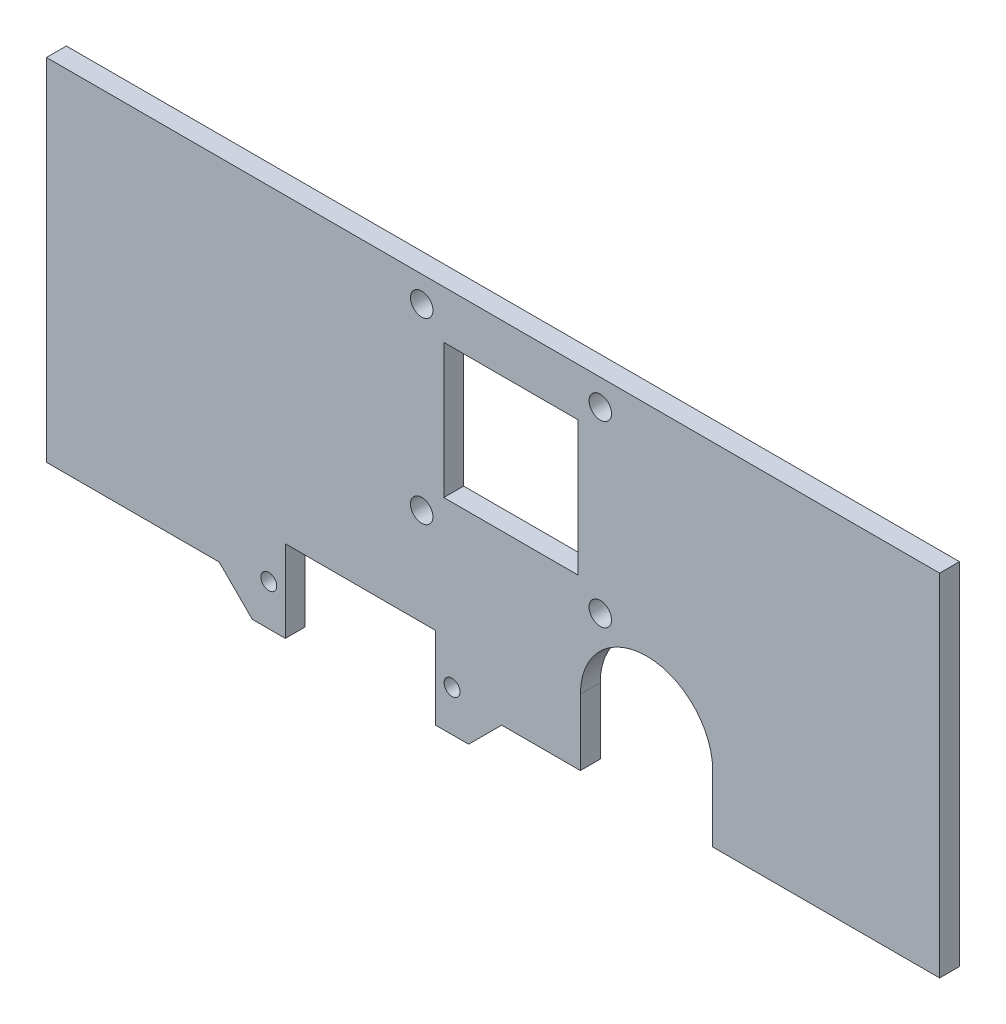
ISO-10303-21;
HEADER;
FILE_DESCRIPTION(('STEP AP214'),'2;1');
FILE_NAME('part.step','',(''),(''),'','','');
FILE_SCHEMA(('AUTOMOTIVE_DESIGN { 1 0 10303 214 1 1 1 1 }'));
ENDSEC;
DATA;
#1=APPLICATION_CONTEXT('core data for automotive mechanical design processes');
#2=APPLICATION_PROTOCOL_DEFINITION('international standard','automotive_design',2000,#1);
#3=PRODUCT_CONTEXT('',#1,'mechanical');
#4=PRODUCT('Part','Part','',(#3));
#5=PRODUCT_RELATED_PRODUCT_CATEGORY('part','',(#4));
#6=PRODUCT_DEFINITION_FORMATION('','',#4);
#7=PRODUCT_DEFINITION_CONTEXT('part definition',#1,'design');
#8=PRODUCT_DEFINITION('design','',#6,#7);
#9=PRODUCT_DEFINITION_SHAPE('','',#8);
#10=(LENGTH_UNIT() NAMED_UNIT(*) SI_UNIT(.MILLI.,.METRE.));
#11=(NAMED_UNIT(*) PLANE_ANGLE_UNIT() SI_UNIT($,.RADIAN.));
#12=(NAMED_UNIT(*) SI_UNIT($,.STERADIAN.) SOLID_ANGLE_UNIT());
#13=UNCERTAINTY_MEASURE_WITH_UNIT(LENGTH_MEASURE(1.E-05),#10,'distance_accuracy_value','');
#14=(GEOMETRIC_REPRESENTATION_CONTEXT(3) GLOBAL_UNCERTAINTY_ASSIGNED_CONTEXT((#13)) GLOBAL_UNIT_ASSIGNED_CONTEXT((#10,
#11,#12)) REPRESENTATION_CONTEXT('',''));
#15=CARTESIAN_POINT('',(0.,0.,0.));
#16=DIRECTION('',(0.,0.,1.));
#17=DIRECTION('',(1.,0.,0.));
#18=AXIS2_PLACEMENT_3D('',#15,#16,#17);
#19=CARTESIAN_POINT('',(0.,0.,3.));
#20=DIRECTION('',(0.,0.,-1.));
#21=DIRECTION('',(-1.,0.,0.));
#22=AXIS2_PLACEMENT_3D('',#19,#20,#21);
#23=PLANE('',#22);
#24=DIRECTION('',(-1.,0.,0.));
#25=VECTOR('',#24,1.);
#26=CARTESIAN_POINT('',(-30.6511945230726,54.0173248927136,3.));
#27=LINE('',#26,#25);
#28=CARTESIAN_POINT('',(-10.3311945230726,54.0173248927136,3.));
#29=VERTEX_POINT('',#28);
#30=CARTESIAN_POINT('',(-30.6511945230726,54.0173248927136,3.));
#31=VERTEX_POINT('',#30);
#32=EDGE_CURVE('E185',#29,#31,#27,.T.);
#33=ORIENTED_EDGE('',*,*,#32,.T.);
#34=DIRECTION('',(0.,1.,0.));
#35=VECTOR('',#34,1.);
#36=CARTESIAN_POINT('',(-30.6511945230726,54.0173248927136,3.));
#37=LINE('',#36,#35);
#38=CARTESIAN_POINT('',(-30.6511945230726,74.3373248927136,3.));
#39=VERTEX_POINT('',#38);
#40=EDGE_CURVE('E179',#31,#39,#37,.T.);
#41=ORIENTED_EDGE('',*,*,#40,.T.);
#42=DIRECTION('',(1.,0.,0.));
#43=VECTOR('',#42,1.);
#44=CARTESIAN_POINT('',(-30.6511945230726,74.3373248927136,3.));
#45=LINE('',#44,#43);
#46=CARTESIAN_POINT('',(-10.3311945230726,74.3373248927136,3.));
#47=VERTEX_POINT('',#46);
#48=EDGE_CURVE('E188',#39,#47,#45,.T.);
#49=ORIENTED_EDGE('',*,*,#48,.T.);
#50=DIRECTION('',(0.,-1.,0.));
#51=VECTOR('',#50,1.);
#52=CARTESIAN_POINT('',(-10.3311945230726,54.0173248927136,3.));
#53=LINE('',#52,#51);
#54=EDGE_CURVE('E50',#47,#29,#53,.T.);
#55=ORIENTED_EDGE('',*,*,#54,.T.);
#56=EDGE_LOOP('',(#33,#41,#49,#55));
#57=FACE_BOUND('',#56,.T.);
#58=CARTESIAN_POINT('',(-29.4,29.8,3.));
#59=DIRECTION('',(0.,0.,1.));
#60=DIRECTION('',(1.,0.,0.));
#61=AXIS2_PLACEMENT_3D('',#58,#59,#60);
#62=CIRCLE('',#61,1.2);
#63=CARTESIAN_POINT('',(-28.2,29.8,3.));
#64=VERTEX_POINT('',#63);
#65=EDGE_CURVE('E209',#64,#64,#62,.T.);
#66=ORIENTED_EDGE('',*,*,#65,.F.);
#67=EDGE_LOOP('',(#66));
#68=FACE_BOUND('',#67,.T.);
#69=CARTESIAN_POINT('',(-57.1,29.8,3.));
#70=DIRECTION('',(0.,0.,1.));
#71=DIRECTION('',(1.,0.,0.));
#72=AXIS2_PLACEMENT_3D('',#69,#70,#71);
#73=CIRCLE('',#72,1.2);
#74=CARTESIAN_POINT('',(-55.9,29.8,3.));
#75=VERTEX_POINT('',#74);
#76=EDGE_CURVE('E218',#75,#75,#73,.T.);
#77=ORIENTED_EDGE('',*,*,#76,.F.);
#78=EDGE_LOOP('',(#77));
#79=FACE_BOUND('',#78,.T.);
#80=CARTESIAN_POINT('',(-6.99119452307264,77.6773248927136,3.));
#81=DIRECTION('',(0.,0.,1.));
#82=DIRECTION('',(1.,0.,0.));
#83=AXIS2_PLACEMENT_3D('',#80,#81,#82);
#84=CIRCLE('',#83,1.7);
#85=CARTESIAN_POINT('',(-5.29119452307264,77.6773248927136,3.));
#86=VERTEX_POINT('',#85);
#87=EDGE_CURVE('E230',#86,#86,#84,.T.);
#88=ORIENTED_EDGE('',*,*,#87,.F.);
#89=EDGE_LOOP('',(#88));
#90=FACE_BOUND('',#89,.T.);
#91=CARTESIAN_POINT('',(-33.9911945230726,50.6773248927136,3.));
#92=DIRECTION('',(0.,0.,1.));
#93=DIRECTION('',(1.,0.,0.));
#94=AXIS2_PLACEMENT_3D('',#91,#92,#93);
#95=CIRCLE('',#94,1.7);
#96=CARTESIAN_POINT('',(-32.2911945230726,50.6773248927136,3.));
#97=VERTEX_POINT('',#96);
#98=EDGE_CURVE('E236',#97,#97,#95,.T.);
#99=ORIENTED_EDGE('',*,*,#98,.F.);
#100=EDGE_LOOP('',(#99));
#101=FACE_BOUND('',#100,.T.);
#102=CARTESIAN_POINT('',(-6.99119452307264,50.6773248927136,3.));
#103=DIRECTION('',(0.,0.,1.));
#104=DIRECTION('',(1.,0.,0.));
#105=AXIS2_PLACEMENT_3D('',#102,#103,#104);
#106=CIRCLE('',#105,1.7);
#107=CARTESIAN_POINT('',(-5.29119452307264,50.6773248927136,3.));
#108=VERTEX_POINT('',#107);
#109=EDGE_CURVE('E242',#108,#108,#106,.T.);
#110=ORIENTED_EDGE('',*,*,#109,.F.);
#111=EDGE_LOOP('',(#110));
#112=FACE_BOUND('',#111,.T.);
#113=DIRECTION('',(1.,0.,0.));
#114=VECTOR('',#113,1.);
#115=CARTESIAN_POINT('',(44.3,28.6,3.));
#116=LINE('',#115,#114);
#117=CARTESIAN_POINT('',(-90.7,28.6,3.));
#118=VERTEX_POINT('',#117);
#119=CARTESIAN_POINT('',(-64.6000000000001,28.6,3.));
#120=VERTEX_POINT('',#119);
#121=EDGE_CURVE('E318',#118,#120,#116,.T.);
#122=ORIENTED_EDGE('',*,*,#121,.T.);
#123=DIRECTION('',(0.707106781186556,-0.707106781186539,0.));
#124=VECTOR('',#123,1.);
#125=CARTESIAN_POINT('',(-59.6,23.6,3.));
#126=LINE('',#125,#124);
#127=CARTESIAN_POINT('',(-59.6,23.6,3.));
#128=VERTEX_POINT('',#127);
#129=EDGE_CURVE('E262',#120,#128,#126,.T.);
#130=ORIENTED_EDGE('',*,*,#129,.T.);
#131=DIRECTION('',(1.,0.,0.));
#132=VECTOR('',#131,1.);
#133=CARTESIAN_POINT('',(-54.6,23.6,3.));
#134=LINE('',#133,#132);
#135=CARTESIAN_POINT('',(-54.6,23.6,3.));
#136=VERTEX_POINT('',#135);
#137=EDGE_CURVE('E271',#128,#136,#134,.T.);
#138=ORIENTED_EDGE('',*,*,#137,.T.);
#139=DIRECTION('',(0.,1.,0.));
#140=VECTOR('',#139,1.);
#141=CARTESIAN_POINT('',(-54.6,23.6,3.));
#142=LINE('',#141,#140);
#143=CARTESIAN_POINT('',(-54.6,36.,3.));
#144=VERTEX_POINT('',#143);
#145=EDGE_CURVE('E291',#136,#144,#142,.T.);
#146=ORIENTED_EDGE('',*,*,#145,.T.);
#147=DIRECTION('',(-1.,0.,0.));
#148=VECTOR('',#147,1.);
#149=CARTESIAN_POINT('',(0.,36.,3.));
#150=LINE('',#149,#148);
#151=CARTESIAN_POINT('',(-31.9,36.,3.));
#152=VERTEX_POINT('',#151);
#153=EDGE_CURVE('E296',#152,#144,#150,.T.);
#154=ORIENTED_EDGE('',*,*,#153,.F.);
#155=DIRECTION('',(0.,1.,0.));
#156=VECTOR('',#155,1.);
#157=CARTESIAN_POINT('',(-31.9,23.6,3.));
#158=LINE('',#157,#156);
#159=CARTESIAN_POINT('',(-31.9,23.6,3.));
#160=VERTEX_POINT('',#159);
#161=EDGE_CURVE('E294',#160,#152,#158,.T.);
#162=ORIENTED_EDGE('',*,*,#161,.F.);
#163=DIRECTION('',(1.,0.,0.));
#164=VECTOR('',#163,1.);
#165=CARTESIAN_POINT('',(-26.9,23.6,3.));
#166=LINE('',#165,#164);
#167=CARTESIAN_POINT('',(-26.9,23.6,3.));
#168=VERTEX_POINT('',#167);
#169=EDGE_CURVE('E251',#160,#168,#166,.T.);
#170=ORIENTED_EDGE('',*,*,#169,.T.);
#171=DIRECTION('',(0.707106781186544,0.707106781186551,0.));
#172=VECTOR('',#171,1.);
#173=CARTESIAN_POINT('',(-21.9,28.6,3.));
#174=LINE('',#173,#172);
#175=CARTESIAN_POINT('',(-21.9,28.6,3.));
#176=VERTEX_POINT('',#175);
#177=EDGE_CURVE('E255',#168,#176,#174,.T.);
#178=ORIENTED_EDGE('',*,*,#177,.T.);
#179=CARTESIAN_POINT('',(-9.99999999999998,28.6,3.));
#180=VERTEX_POINT('',#179);
#181=EDGE_CURVE('E322',#176,#180,#116,.T.);
#182=ORIENTED_EDGE('',*,*,#181,.T.);
#183=DIRECTION('',(0.,-1.,0.));
#184=VECTOR('',#183,1.);
#185=CARTESIAN_POINT('',(-9.99999999999998,48.6,3.));
#186=LINE('',#185,#184);
#187=CARTESIAN_POINT('',(-9.99999999999998,38.6,3.));
#188=VERTEX_POINT('',#187);
#189=EDGE_CURVE('E305',#188,#180,#186,.T.);
#190=ORIENTED_EDGE('',*,*,#189,.F.);
#191=CARTESIAN_POINT('',(0.,38.6,3.));
#192=DIRECTION('',(0.,0.,-1.));
#193=DIRECTION('',(-1.,0.,0.));
#194=AXIS2_PLACEMENT_3D('',#191,#192,#193);
#195=CIRCLE('',#194,10.);
#196=CARTESIAN_POINT('',(0.,48.6,3.));
#197=VERTEX_POINT('',#196);
#198=EDGE_CURVE('E363',#188,#197,#195,.T.);
#199=ORIENTED_EDGE('',*,*,#198,.T.);
#200=CARTESIAN_POINT('',(0.,38.6,3.));
#201=DIRECTION('',(0.,0.,-1.));
#202=DIRECTION('',(-1.,0.,0.));
#203=AXIS2_PLACEMENT_3D('',#200,#201,#202);
#204=CIRCLE('',#203,10.);
#205=CARTESIAN_POINT('',(10.,38.6,3.));
#206=VERTEX_POINT('',#205);
#207=EDGE_CURVE('E43',#197,#206,#204,.T.);
#208=ORIENTED_EDGE('',*,*,#207,.T.);
#209=DIRECTION('',(0.,-1.,0.));
#210=VECTOR('',#209,1.);
#211=CARTESIAN_POINT('',(10.,48.6,3.));
#212=LINE('',#211,#210);
#213=CARTESIAN_POINT('',(10.,28.6,3.));
#214=VERTEX_POINT('',#213);
#215=EDGE_CURVE('E308',#206,#214,#212,.T.);
#216=ORIENTED_EDGE('',*,*,#215,.T.);
#217=CARTESIAN_POINT('',(44.3,28.6,3.));
#218=VERTEX_POINT('',#217);
#219=EDGE_CURVE('E316',#214,#218,#116,.T.);
#220=ORIENTED_EDGE('',*,*,#219,.T.);
#221=DIRECTION('',(0.,1.,0.));
#222=VECTOR('',#221,1.);
#223=CARTESIAN_POINT('',(44.3,81.6,3.));
#224=LINE('',#223,#222);
#225=CARTESIAN_POINT('',(44.3,81.6,3.));
#226=VERTEX_POINT('',#225);
#227=EDGE_CURVE('E321',#218,#226,#224,.T.);
#228=ORIENTED_EDGE('',*,*,#227,.T.);
#229=DIRECTION('',(-1.,0.,0.));
#230=VECTOR('',#229,1.);
#231=CARTESIAN_POINT('',(-90.7,81.6,3.));
#232=LINE('',#231,#230);
#233=CARTESIAN_POINT('',(-90.7,81.6,3.));
#234=VERTEX_POINT('',#233);
#235=EDGE_CURVE('E324',#226,#234,#232,.T.);
#236=ORIENTED_EDGE('',*,*,#235,.T.);
#237=DIRECTION('',(0.,-1.,0.));
#238=VECTOR('',#237,1.);
#239=CARTESIAN_POINT('',(-90.7,28.6,3.));
#240=LINE('',#239,#238);
#241=EDGE_CURVE('E313',#234,#118,#240,.T.);
#242=ORIENTED_EDGE('',*,*,#241,.T.);
#243=EDGE_LOOP('',(#122,#130,#138,#146,#154,#162,#170,#178,#182,#190,#199,#208,#216,#220,#228,
#236,#242));
#244=FACE_BOUND('',#243,.T.);
#245=CARTESIAN_POINT('',(-33.9911945230726,77.6773248927136,3.));
#246=DIRECTION('',(0.,0.,1.));
#247=DIRECTION('',(1.,0.,0.));
#248=AXIS2_PLACEMENT_3D('',#245,#246,#247);
#249=CIRCLE('',#248,1.7);
#250=CARTESIAN_POINT('',(-32.2911945230726,77.6773248927136,3.));
#251=VERTEX_POINT('',#250);
#252=EDGE_CURVE('E224',#251,#251,#249,.T.);
#253=ORIENTED_EDGE('',*,*,#252,.F.);
#254=EDGE_LOOP('',(#253));
#255=FACE_BOUND('',#254,.T.);
#256=ADVANCED_FACE('F34',(#57,#68,#79,#90,#101,#112,#244,#255),#23,.F.);
#257=CARTESIAN_POINT('',(44.3,28.6,3.));
#258=DIRECTION('',(0.,1.,0.));
#259=DIRECTION('',(0.,0.,1.));
#260=AXIS2_PLACEMENT_3D('',#257,#258,#259);
#261=PLANE('',#260);
#262=ORIENTED_EDGE('',*,*,#181,.F.);
#263=DIRECTION('',(0.,0.,1.));
#264=VECTOR('',#263,1.);
#265=CARTESIAN_POINT('',(-21.9,28.6,0.));
#266=LINE('',#265,#264);
#267=CARTESIAN_POINT('',(-21.9,28.6,0.));
#268=VERTEX_POINT('',#267);
#269=EDGE_CURVE('E254',#268,#176,#266,.T.);
#270=ORIENTED_EDGE('',*,*,#269,.F.);
#271=DIRECTION('',(1.,0.,0.));
#272=VECTOR('',#271,1.);
#273=CARTESIAN_POINT('',(44.3,28.6,0.));
#274=LINE('',#273,#272);
#275=CARTESIAN_POINT('',(-9.99999999999998,28.6,0.));
#276=VERTEX_POINT('',#275);
#277=EDGE_CURVE('E334',#268,#276,#274,.T.);
#278=ORIENTED_EDGE('',*,*,#277,.T.);
#279=DIRECTION('',(0.,0.,-1.));
#280=VECTOR('',#279,1.);
#281=CARTESIAN_POINT('',(-9.99999999999998,28.6,0.));
#282=LINE('',#281,#280);
#283=EDGE_CURVE('E298',#180,#276,#282,.T.);
#284=ORIENTED_EDGE('',*,*,#283,.F.);
#285=EDGE_LOOP('',(#262,#270,#278,#284));
#286=FACE_BOUND('',#285,.T.);
#287=ADVANCED_FACE('F398',(#286),#261,.F.);
#288=CARTESIAN_POINT('',(-90.7,28.6,0.));
#289=VERTEX_POINT('',#288);
#290=CARTESIAN_POINT('',(-64.6000000000001,28.6,0.));
#291=VERTEX_POINT('',#290);
#292=EDGE_CURVE('E330',#289,#291,#274,.T.);
#293=ORIENTED_EDGE('',*,*,#292,.T.);
#294=DIRECTION('',(0.,0.,1.));
#295=VECTOR('',#294,1.);
#296=CARTESIAN_POINT('',(-64.6000000000001,28.6,0.));
#297=LINE('',#296,#295);
#298=EDGE_CURVE('E274',#291,#120,#297,.T.);
#299=ORIENTED_EDGE('',*,*,#298,.T.);
#300=ORIENTED_EDGE('',*,*,#121,.F.);
#301=DIRECTION('',(0.,0.,-1.));
#302=VECTOR('',#301,1.);
#303=CARTESIAN_POINT('',(-90.7,28.6,3.));
#304=LINE('',#303,#302);
#305=EDGE_CURVE('E345',#118,#289,#304,.T.);
#306=ORIENTED_EDGE('',*,*,#305,.T.);
#307=EDGE_LOOP('',(#293,#299,#300,#306));
#308=FACE_BOUND('',#307,.T.);
#309=ADVANCED_FACE('F420',(#308),#261,.F.);
#310=CARTESIAN_POINT('',(0.,0.,0.));
#311=DIRECTION('',(0.,0.,-1.));
#312=DIRECTION('',(-1.,0.,0.));
#313=AXIS2_PLACEMENT_3D('',#310,#311,#312);
#314=PLANE('',#313);
#315=DIRECTION('',(0.,1.,0.));
#316=VECTOR('',#315,1.);
#317=CARTESIAN_POINT('',(-30.6511945230726,54.0173248927136,0.));
#318=LINE('',#317,#316);
#319=CARTESIAN_POINT('',(-30.6511945230726,54.0173248927136,0.));
#320=VERTEX_POINT('',#319);
#321=CARTESIAN_POINT('',(-30.6511945230726,74.3373248927136,0.));
#322=VERTEX_POINT('',#321);
#323=EDGE_CURVE('E58',#320,#322,#318,.T.);
#324=ORIENTED_EDGE('',*,*,#323,.F.);
#325=DIRECTION('',(-1.,0.,0.));
#326=VECTOR('',#325,1.);
#327=CARTESIAN_POINT('',(-30.6511945230726,54.0173248927136,0.));
#328=LINE('',#327,#326);
#329=CARTESIAN_POINT('',(-10.3311945230726,54.0173248927136,0.));
#330=VERTEX_POINT('',#329);
#331=EDGE_CURVE('E194',#330,#320,#328,.T.);
#332=ORIENTED_EDGE('',*,*,#331,.F.);
#333=DIRECTION('',(0.,-1.,0.));
#334=VECTOR('',#333,1.);
#335=CARTESIAN_POINT('',(-10.3311945230726,54.0173248927136,0.));
#336=LINE('',#335,#334);
#337=CARTESIAN_POINT('',(-10.3311945230726,74.3373248927136,0.));
#338=VERTEX_POINT('',#337);
#339=EDGE_CURVE('E197',#338,#330,#336,.T.);
#340=ORIENTED_EDGE('',*,*,#339,.F.);
#341=DIRECTION('',(1.,0.,0.));
#342=VECTOR('',#341,1.);
#343=CARTESIAN_POINT('',(-30.6511945230726,74.3373248927136,0.));
#344=LINE('',#343,#342);
#345=EDGE_CURVE('E203',#322,#338,#344,.T.);
#346=ORIENTED_EDGE('',*,*,#345,.F.);
#347=EDGE_LOOP('',(#324,#332,#340,#346));
#348=FACE_BOUND('',#347,.T.);
#349=CARTESIAN_POINT('',(-29.4,29.8,0.));
#350=DIRECTION('',(0.,0.,1.));
#351=DIRECTION('',(1.,0.,0.));
#352=AXIS2_PLACEMENT_3D('',#349,#350,#351);
#353=CIRCLE('',#352,1.2);
#354=CARTESIAN_POINT('',(-28.2,29.8,0.));
#355=VERTEX_POINT('',#354);
#356=EDGE_CURVE('E215',#355,#355,#353,.T.);
#357=ORIENTED_EDGE('',*,*,#356,.T.);
#358=EDGE_LOOP('',(#357));
#359=FACE_BOUND('',#358,.T.);
#360=CARTESIAN_POINT('',(-57.1,29.8,0.));
#361=DIRECTION('',(0.,0.,1.));
#362=DIRECTION('',(1.,0.,0.));
#363=AXIS2_PLACEMENT_3D('',#360,#361,#362);
#364=CIRCLE('',#363,1.2);
#365=CARTESIAN_POINT('',(-55.9,29.8,0.));
#366=VERTEX_POINT('',#365);
#367=EDGE_CURVE('E221',#366,#366,#364,.T.);
#368=ORIENTED_EDGE('',*,*,#367,.T.);
#369=EDGE_LOOP('',(#368));
#370=FACE_BOUND('',#369,.T.);
#371=CARTESIAN_POINT('',(-33.9911945230726,77.6773248927136,0.));
#372=DIRECTION('',(0.,0.,1.));
#373=DIRECTION('',(1.,0.,0.));
#374=AXIS2_PLACEMENT_3D('',#371,#372,#373);
#375=CIRCLE('',#374,1.7);
#376=CARTESIAN_POINT('',(-32.2911945230726,77.6773248927136,0.));
#377=VERTEX_POINT('',#376);
#378=EDGE_CURVE('E227',#377,#377,#375,.T.);
#379=ORIENTED_EDGE('',*,*,#378,.T.);
#380=EDGE_LOOP('',(#379));
#381=FACE_BOUND('',#380,.T.);
#382=CARTESIAN_POINT('',(-6.99119452307264,77.6773248927136,0.));
#383=DIRECTION('',(0.,0.,1.));
#384=DIRECTION('',(1.,0.,0.));
#385=AXIS2_PLACEMENT_3D('',#382,#383,#384);
#386=CIRCLE('',#385,1.7);
#387=CARTESIAN_POINT('',(-5.29119452307264,77.6773248927136,0.));
#388=VERTEX_POINT('',#387);
#389=EDGE_CURVE('E233',#388,#388,#386,.T.);
#390=ORIENTED_EDGE('',*,*,#389,.T.);
#391=EDGE_LOOP('',(#390));
#392=FACE_BOUND('',#391,.T.);
#393=CARTESIAN_POINT('',(-33.9911945230726,50.6773248927136,0.));
#394=DIRECTION('',(0.,0.,1.));
#395=DIRECTION('',(1.,0.,0.));
#396=AXIS2_PLACEMENT_3D('',#393,#394,#395);
#397=CIRCLE('',#396,1.7);
#398=CARTESIAN_POINT('',(-32.2911945230726,50.6773248927136,0.));
#399=VERTEX_POINT('',#398);
#400=EDGE_CURVE('E239',#399,#399,#397,.T.);
#401=ORIENTED_EDGE('',*,*,#400,.T.);
#402=EDGE_LOOP('',(#401));
#403=FACE_BOUND('',#402,.T.);
#404=CARTESIAN_POINT('',(-6.99119452307264,50.6773248927136,0.));
#405=DIRECTION('',(0.,0.,1.));
#406=DIRECTION('',(1.,0.,0.));
#407=AXIS2_PLACEMENT_3D('',#404,#405,#406);
#408=CIRCLE('',#407,1.7);
#409=CARTESIAN_POINT('',(-5.29119452307264,50.6773248927136,0.));
#410=VERTEX_POINT('',#409);
#411=EDGE_CURVE('E245',#410,#410,#408,.T.);
#412=ORIENTED_EDGE('',*,*,#411,.T.);
#413=EDGE_LOOP('',(#412));
#414=FACE_BOUND('',#413,.T.);
#415=ORIENTED_EDGE('',*,*,#277,.F.);
#416=DIRECTION('',(0.707106781186544,0.707106781186551,0.));
#417=VECTOR('',#416,1.);
#418=CARTESIAN_POINT('',(-21.9,28.6,0.));
#419=LINE('',#418,#417);
#420=CARTESIAN_POINT('',(-26.9,23.6,0.));
#421=VERTEX_POINT('',#420);
#422=EDGE_CURVE('E248',#421,#268,#419,.T.);
#423=ORIENTED_EDGE('',*,*,#422,.F.);
#424=DIRECTION('',(1.,0.,0.));
#425=VECTOR('',#424,1.);
#426=CARTESIAN_POINT('',(-26.9,23.6,0.));
#427=LINE('',#426,#425);
#428=CARTESIAN_POINT('',(-31.9,23.6,0.));
#429=VERTEX_POINT('',#428);
#430=EDGE_CURVE('E250',#429,#421,#427,.T.);
#431=ORIENTED_EDGE('',*,*,#430,.F.);
#432=DIRECTION('',(0.,1.,0.));
#433=VECTOR('',#432,1.);
#434=CARTESIAN_POINT('',(-31.9,0.,0.));
#435=LINE('',#434,#433);
#436=CARTESIAN_POINT('',(-31.9,36.,0.));
#437=VERTEX_POINT('',#436);
#438=EDGE_CURVE('E353',#429,#437,#435,.T.);
#439=ORIENTED_EDGE('',*,*,#438,.T.);
#440=DIRECTION('',(-1.,0.,0.));
#441=VECTOR('',#440,1.);
#442=CARTESIAN_POINT('',(0.,36.,0.));
#443=LINE('',#442,#441);
#444=CARTESIAN_POINT('',(-54.6,36.,0.));
#445=VERTEX_POINT('',#444);
#446=EDGE_CURVE('E348',#437,#445,#443,.T.);
#447=ORIENTED_EDGE('',*,*,#446,.T.);
#448=DIRECTION('',(0.,-1.,0.));
#449=VECTOR('',#448,1.);
#450=CARTESIAN_POINT('',(-54.6,0.,0.));
#451=LINE('',#450,#449);
#452=CARTESIAN_POINT('',(-54.6,23.6,0.));
#453=VERTEX_POINT('',#452);
#454=EDGE_CURVE('E351',#445,#453,#451,.T.);
#455=ORIENTED_EDGE('',*,*,#454,.T.);
#456=DIRECTION('',(1.,0.,0.));
#457=VECTOR('',#456,1.);
#458=CARTESIAN_POINT('',(-54.6,23.6,0.));
#459=LINE('',#458,#457);
#460=CARTESIAN_POINT('',(-59.6,23.6,0.));
#461=VERTEX_POINT('',#460);
#462=EDGE_CURVE('E270',#461,#453,#459,.T.);
#463=ORIENTED_EDGE('',*,*,#462,.F.);
#464=DIRECTION('',(0.707106781186556,-0.707106781186539,0.));
#465=VECTOR('',#464,1.);
#466=CARTESIAN_POINT('',(-59.6,23.6,0.));
#467=LINE('',#466,#465);
#468=EDGE_CURVE('E267',#291,#461,#467,.T.);
#469=ORIENTED_EDGE('',*,*,#468,.F.);
#470=ORIENTED_EDGE('',*,*,#292,.F.);
#471=DIRECTION('',(0.,-1.,0.));
#472=VECTOR('',#471,1.);
#473=CARTESIAN_POINT('',(-90.7,28.6,0.));
#474=LINE('',#473,#472);
#475=CARTESIAN_POINT('',(-90.7,81.6,0.));
#476=VERTEX_POINT('',#475);
#477=EDGE_CURVE('E307',#476,#289,#474,.T.);
#478=ORIENTED_EDGE('',*,*,#477,.F.);
#479=DIRECTION('',(-1.,0.,0.));
#480=VECTOR('',#479,1.);
#481=CARTESIAN_POINT('',(-90.7,81.6,0.));
#482=LINE('',#481,#480);
#483=CARTESIAN_POINT('',(44.3,81.6,0.));
#484=VERTEX_POINT('',#483);
#485=EDGE_CURVE('E317',#484,#476,#482,.T.);
#486=ORIENTED_EDGE('',*,*,#485,.F.);
#487=DIRECTION('',(0.,1.,0.));
#488=VECTOR('',#487,1.);
#489=CARTESIAN_POINT('',(44.3,81.6,0.));
#490=LINE('',#489,#488);
#491=CARTESIAN_POINT('',(44.3,28.6,0.));
#492=VERTEX_POINT('',#491);
#493=EDGE_CURVE('E333',#492,#484,#490,.T.);
#494=ORIENTED_EDGE('',*,*,#493,.F.);
#495=CARTESIAN_POINT('',(10.,28.6,0.));
#496=VERTEX_POINT('',#495);
#497=EDGE_CURVE('E329',#496,#492,#274,.T.);
#498=ORIENTED_EDGE('',*,*,#497,.F.);
#499=DIRECTION('',(0.,-1.,0.));
#500=VECTOR('',#499,1.);
#501=CARTESIAN_POINT('',(10.,48.6,0.));
#502=LINE('',#501,#500);
#503=CARTESIAN_POINT('',(10.,38.6,0.));
#504=VERTEX_POINT('',#503);
#505=EDGE_CURVE('E310',#504,#496,#502,.T.);
#506=ORIENTED_EDGE('',*,*,#505,.F.);
#507=CARTESIAN_POINT('',(0.,38.6,0.));
#508=DIRECTION('',(0.,0.,-1.));
#509=DIRECTION('',(-1.,0.,0.));
#510=AXIS2_PLACEMENT_3D('',#507,#508,#509);
#511=CIRCLE('',#510,10.);
#512=CARTESIAN_POINT('',(0.,48.6,0.));
#513=VERTEX_POINT('',#512);
#514=EDGE_CURVE('E11',#504,#513,#511,.F.);
#515=ORIENTED_EDGE('',*,*,#514,.T.);
#516=CARTESIAN_POINT('',(0.,38.6,0.));
#517=DIRECTION('',(0.,0.,-1.));
#518=DIRECTION('',(-1.,0.,0.));
#519=AXIS2_PLACEMENT_3D('',#516,#517,#518);
#520=CIRCLE('',#519,10.);
#521=CARTESIAN_POINT('',(-9.99999999999998,38.6,0.));
#522=VERTEX_POINT('',#521);
#523=EDGE_CURVE('E361',#513,#522,#520,.F.);
#524=ORIENTED_EDGE('',*,*,#523,.T.);
#525=DIRECTION('',(0.,-1.,0.));
#526=VECTOR('',#525,1.);
#527=CARTESIAN_POINT('',(-9.99999999999998,48.6,0.));
#528=LINE('',#527,#526);
#529=EDGE_CURVE('E304',#522,#276,#528,.T.);
#530=ORIENTED_EDGE('',*,*,#529,.T.);
#531=EDGE_LOOP('',(#415,#423,#431,#439,#447,#455,#463,#469,#470,#478,#486,#494,#498,#506,#515,
#524,#530));
#532=FACE_BOUND('',#531,.T.);
#533=ADVANCED_FACE('F383',(#348,#359,#370,#381,#392,#403,#414,#532),#314,.T.);
#534=CARTESIAN_POINT('',(-90.7,28.6,3.));
#535=DIRECTION('',(1.,0.,0.));
#536=DIRECTION('',(0.,1.,0.));
#537=AXIS2_PLACEMENT_3D('',#534,#535,#536);
#538=PLANE('',#537);
#539=ORIENTED_EDGE('',*,*,#477,.T.);
#540=ORIENTED_EDGE('',*,*,#305,.F.);
#541=ORIENTED_EDGE('',*,*,#241,.F.);
#542=DIRECTION('',(0.,0.,-1.));
#543=VECTOR('',#542,1.);
#544=CARTESIAN_POINT('',(-90.7,81.6,3.));
#545=LINE('',#544,#543);
#546=EDGE_CURVE('E326',#234,#476,#545,.T.);
#547=ORIENTED_EDGE('',*,*,#546,.T.);
#548=EDGE_LOOP('',(#539,#540,#541,#547));
#549=FACE_BOUND('',#548,.T.);
#550=ADVANCED_FACE('F427',(#549),#538,.F.);
#551=ORIENTED_EDGE('',*,*,#219,.F.);
#552=DIRECTION('',(0.,0.,1.));
#553=VECTOR('',#552,1.);
#554=CARTESIAN_POINT('',(10.,28.6,0.));
#555=LINE('',#554,#553);
#556=EDGE_CURVE('E301',#496,#214,#555,.T.);
#557=ORIENTED_EDGE('',*,*,#556,.F.);
#558=ORIENTED_EDGE('',*,*,#497,.T.);
#559=DIRECTION('',(0.,0.,-1.));
#560=VECTOR('',#559,1.);
#561=CARTESIAN_POINT('',(44.3,28.6,3.));
#562=LINE('',#561,#560);
#563=EDGE_CURVE('E342',#218,#492,#562,.T.);
#564=ORIENTED_EDGE('',*,*,#563,.F.);
#565=EDGE_LOOP('',(#551,#557,#558,#564));
#566=FACE_BOUND('',#565,.T.);
#567=ADVANCED_FACE('F388',(#566),#261,.F.);
#568=CARTESIAN_POINT('',(44.3,81.6,3.));
#569=DIRECTION('',(-1.,0.,0.));
#570=DIRECTION('',(0.,-1.,0.));
#571=AXIS2_PLACEMENT_3D('',#568,#569,#570);
#572=PLANE('',#571);
#573=ORIENTED_EDGE('',*,*,#493,.T.);
#574=DIRECTION('',(0.,0.,-1.));
#575=VECTOR('',#574,1.);
#576=CARTESIAN_POINT('',(44.3,81.6,3.));
#577=LINE('',#576,#575);
#578=EDGE_CURVE('E339',#226,#484,#577,.T.);
#579=ORIENTED_EDGE('',*,*,#578,.F.);
#580=ORIENTED_EDGE('',*,*,#227,.F.);
#581=ORIENTED_EDGE('',*,*,#563,.T.);
#582=EDGE_LOOP('',(#573,#579,#580,#581));
#583=FACE_BOUND('',#582,.T.);
#584=ADVANCED_FACE('F432',(#583),#572,.F.);
#585=CARTESIAN_POINT('',(-90.7,81.6,3.));
#586=DIRECTION('',(0.,-1.,0.));
#587=DIRECTION('',(0.,0.,-1.));
#588=AXIS2_PLACEMENT_3D('',#585,#586,#587);
#589=PLANE('',#588);
#590=ORIENTED_EDGE('',*,*,#485,.T.);
#591=ORIENTED_EDGE('',*,*,#546,.F.);
#592=ORIENTED_EDGE('',*,*,#235,.F.);
#593=ORIENTED_EDGE('',*,*,#578,.T.);
#594=EDGE_LOOP('',(#590,#591,#592,#593));
#595=FACE_BOUND('',#594,.T.);
#596=ADVANCED_FACE('F429',(#595),#589,.F.);
#597=CARTESIAN_POINT('',(-9.99999999999998,48.6,0.));
#598=DIRECTION('',(-1.,0.,0.));
#599=DIRECTION('',(0.,0.,1.));
#600=AXIS2_PLACEMENT_3D('',#597,#598,#599);
#601=PLANE('',#600);
#602=ORIENTED_EDGE('',*,*,#529,.F.);
#603=DIRECTION('',(0.,0.,-1.));
#604=VECTOR('',#603,1.);
#605=CARTESIAN_POINT('',(-9.99999999999998,38.6,3.));
#606=LINE('',#605,#604);
#607=EDGE_CURVE('E356',#522,#188,#606,.F.);
#608=ORIENTED_EDGE('',*,*,#607,.T.);
#609=ORIENTED_EDGE('',*,*,#189,.T.);
#610=ORIENTED_EDGE('',*,*,#283,.T.);
#611=EDGE_LOOP('',(#602,#608,#609,#610));
#612=FACE_BOUND('',#611,.T.);
#613=ADVANCED_FACE('F400',(#612),#601,.F.);
#614=CARTESIAN_POINT('',(10.,48.6,0.));
#615=DIRECTION('',(1.,0.,0.));
#616=DIRECTION('',(0.,0.,-1.));
#617=AXIS2_PLACEMENT_3D('',#614,#615,#616);
#618=PLANE('',#617);
#619=ORIENTED_EDGE('',*,*,#215,.F.);
#620=DIRECTION('',(0.,0.,1.));
#621=VECTOR('',#620,1.);
#622=CARTESIAN_POINT('',(10.,38.6,0.));
#623=LINE('',#622,#621);
#624=EDGE_CURVE('E359',#206,#504,#623,.F.);
#625=ORIENTED_EDGE('',*,*,#624,.T.);
#626=ORIENTED_EDGE('',*,*,#505,.T.);
#627=ORIENTED_EDGE('',*,*,#556,.T.);
#628=EDGE_LOOP('',(#619,#625,#626,#627));
#629=FACE_BOUND('',#628,.T.);
#630=ADVANCED_FACE('F375',(#629),#618,.F.);
#631=CARTESIAN_POINT('',(-31.9,23.6,3.));
#632=DIRECTION('',(-1.,0.,0.));
#633=DIRECTION('',(0.,0.,-1.));
#634=AXIS2_PLACEMENT_3D('',#631,#632,#633);
#635=PLANE('',#634);
#636=ORIENTED_EDGE('',*,*,#438,.F.);
#637=DIRECTION('',(0.,0.,1.));
#638=VECTOR('',#637,1.);
#639=CARTESIAN_POINT('',(-31.9,23.6,0.));
#640=LINE('',#639,#638);
#641=EDGE_CURVE('E263',#429,#160,#640,.T.);
#642=ORIENTED_EDGE('',*,*,#641,.T.);
#643=ORIENTED_EDGE('',*,*,#161,.T.);
#644=DIRECTION('',(0.,0.,1.));
#645=VECTOR('',#644,1.);
#646=CARTESIAN_POINT('',(-31.9,36.,3.));
#647=LINE('',#646,#645);
#648=EDGE_CURVE('E282',#437,#152,#647,.T.);
#649=ORIENTED_EDGE('',*,*,#648,.F.);
#650=EDGE_LOOP('',(#636,#642,#643,#649));
#651=FACE_BOUND('',#650,.T.);
#652=ADVANCED_FACE('F466',(#651),#635,.T.);
#653=CARTESIAN_POINT('',(-54.6,23.6,3.));
#654=DIRECTION('',(1.,0.,0.));
#655=DIRECTION('',(0.,0.,1.));
#656=AXIS2_PLACEMENT_3D('',#653,#654,#655);
#657=PLANE('',#656);
#658=ORIENTED_EDGE('',*,*,#145,.F.);
#659=DIRECTION('',(0.,0.,1.));
#660=VECTOR('',#659,1.);
#661=CARTESIAN_POINT('',(-54.6,23.6,0.));
#662=LINE('',#661,#660);
#663=EDGE_CURVE('E279',#453,#136,#662,.T.);
#664=ORIENTED_EDGE('',*,*,#663,.F.);
#665=ORIENTED_EDGE('',*,*,#454,.F.);
#666=DIRECTION('',(0.,0.,-1.));
#667=VECTOR('',#666,1.);
#668=CARTESIAN_POINT('',(-54.6,36.,3.));
#669=LINE('',#668,#667);
#670=EDGE_CURVE('E289',#144,#445,#669,.T.);
#671=ORIENTED_EDGE('',*,*,#670,.F.);
#672=EDGE_LOOP('',(#658,#664,#665,#671));
#673=FACE_BOUND('',#672,.T.);
#674=ADVANCED_FACE('F459',(#673),#657,.T.);
#675=CARTESIAN_POINT('',(-43.25,36.,-2.));
#676=DIRECTION('',(0.,-1.,0.));
#677=DIRECTION('',(0.,0.,-1.));
#678=AXIS2_PLACEMENT_3D('',#675,#676,#677);
#679=PLANE('',#678);
#680=ORIENTED_EDGE('',*,*,#153,.T.);
#681=ORIENTED_EDGE('',*,*,#670,.T.);
#682=ORIENTED_EDGE('',*,*,#446,.F.);
#683=ORIENTED_EDGE('',*,*,#648,.T.);
#684=EDGE_LOOP('',(#680,#681,#682,#683));
#685=FACE_BOUND('',#684,.T.);
#686=ADVANCED_FACE('F463',(#685),#679,.T.);
#687=CARTESIAN_POINT('',(-54.6,23.6,0.));
#688=DIRECTION('',(0.,-1.,0.));
#689=DIRECTION('',(0.,0.,-1.));
#690=AXIS2_PLACEMENT_3D('',#687,#688,#689);
#691=PLANE('',#690);
#692=ORIENTED_EDGE('',*,*,#137,.F.);
#693=DIRECTION('',(0.,0.,1.));
#694=VECTOR('',#693,1.);
#695=CARTESIAN_POINT('',(-59.6,23.6,0.));
#696=LINE('',#695,#694);
#697=EDGE_CURVE('E283',#461,#128,#696,.T.);
#698=ORIENTED_EDGE('',*,*,#697,.F.);
#699=ORIENTED_EDGE('',*,*,#462,.T.);
#700=ORIENTED_EDGE('',*,*,#663,.T.);
#701=EDGE_LOOP('',(#692,#698,#699,#700));
#702=FACE_BOUND('',#701,.T.);
#703=ADVANCED_FACE('F455',(#702),#691,.T.);
#704=CARTESIAN_POINT('',(-59.6,23.6,0.));
#705=DIRECTION('',(-0.707106781186539,-0.707106781186556,0.));
#706=DIRECTION('',(0.707106781186556,-0.707106781186539,0.));
#707=AXIS2_PLACEMENT_3D('',#704,#705,#706);
#708=PLANE('',#707);
#709=ORIENTED_EDGE('',*,*,#129,.F.);
#710=ORIENTED_EDGE('',*,*,#298,.F.);
#711=ORIENTED_EDGE('',*,*,#468,.T.);
#712=ORIENTED_EDGE('',*,*,#697,.T.);
#713=EDGE_LOOP('',(#709,#710,#711,#712));
#714=FACE_BOUND('',#713,.T.);
#715=ADVANCED_FACE('F453',(#714),#708,.T.);
#716=CARTESIAN_POINT('',(-21.9,28.6,0.));
#717=DIRECTION('',(0.707106781186551,-0.707106781186544,0.));
#718=DIRECTION('',(0.707106781186544,0.707106781186551,0.));
#719=AXIS2_PLACEMENT_3D('',#716,#717,#718);
#720=PLANE('',#719);
#721=ORIENTED_EDGE('',*,*,#177,.F.);
#722=DIRECTION('',(0.,0.,1.));
#723=VECTOR('',#722,1.);
#724=CARTESIAN_POINT('',(-26.9,23.6,0.));
#725=LINE('',#724,#723);
#726=EDGE_CURVE('E260',#421,#168,#725,.T.);
#727=ORIENTED_EDGE('',*,*,#726,.F.);
#728=ORIENTED_EDGE('',*,*,#422,.T.);
#729=ORIENTED_EDGE('',*,*,#269,.T.);
#730=EDGE_LOOP('',(#721,#727,#728,#729));
#731=FACE_BOUND('',#730,.T.);
#732=ADVANCED_FACE('F473',(#731),#720,.T.);
#733=CARTESIAN_POINT('',(-26.9,23.6,0.));
#734=DIRECTION('',(0.,-1.,0.));
#735=DIRECTION('',(1.,0.,0.));
#736=AXIS2_PLACEMENT_3D('',#733,#734,#735);
#737=PLANE('',#736);
#738=ORIENTED_EDGE('',*,*,#169,.F.);
#739=ORIENTED_EDGE('',*,*,#641,.F.);
#740=ORIENTED_EDGE('',*,*,#430,.T.);
#741=ORIENTED_EDGE('',*,*,#726,.T.);
#742=EDGE_LOOP('',(#738,#739,#740,#741));
#743=FACE_BOUND('',#742,.T.);
#744=ADVANCED_FACE('F413',(#743),#737,.T.);
#745=CARTESIAN_POINT('',(0.,38.6,0.));
#746=DIRECTION('',(0.,0.,-1.));
#747=DIRECTION('',(-1.,0.,0.));
#748=AXIS2_PLACEMENT_3D('',#745,#746,#747);
#749=CYLINDRICAL_SURFACE('',#748,10.);
#750=ORIENTED_EDGE('',*,*,#624,.F.);
#751=ORIENTED_EDGE('',*,*,#207,.F.);
#752=DIRECTION('',(0.,0.,1.));
#753=VECTOR('',#752,1.);
#754=CARTESIAN_POINT('',(0.,48.6,3.00000000000001));
#755=LINE('',#754,#753);
#756=EDGE_CURVE('E38',#513,#197,#755,.T.);
#757=ORIENTED_EDGE('',*,*,#756,.F.);
#758=ORIENTED_EDGE('',*,*,#514,.F.);
#759=EDGE_LOOP('',(#750,#751,#757,#758));
#760=FACE_BOUND('',#759,.T.);
#761=ADVANCED_FACE('F36',(#760),#749,.F.);
#762=CARTESIAN_POINT('',(0.,38.6,0.));
#763=DIRECTION('',(0.,0.,1.));
#764=DIRECTION('',(1.,0.,0.));
#765=AXIS2_PLACEMENT_3D('',#762,#763,#764);
#766=CYLINDRICAL_SURFACE('',#765,10.);
#767=ORIENTED_EDGE('',*,*,#198,.F.);
#768=ORIENTED_EDGE('',*,*,#607,.F.);
#769=ORIENTED_EDGE('',*,*,#523,.F.);
#770=ORIENTED_EDGE('',*,*,#756,.T.);
#771=EDGE_LOOP('',(#767,#768,#769,#770));
#772=FACE_BOUND('',#771,.T.);
#773=ADVANCED_FACE('F403',(#772),#766,.F.);
#774=CARTESIAN_POINT('',(-6.99119452307264,50.6773248927136,3.));
#775=DIRECTION('',(0.,0.,1.));
#776=DIRECTION('',(1.,0.,0.));
#777=AXIS2_PLACEMENT_3D('',#774,#775,#776);
#778=CYLINDRICAL_SURFACE('',#777,1.7);
#779=ORIENTED_EDGE('',*,*,#411,.F.);
#780=EDGE_LOOP('',(#779));
#781=FACE_BOUND('',#780,.T.);
#782=ORIENTED_EDGE('',*,*,#109,.T.);
#783=EDGE_LOOP('',(#782));
#784=FACE_BOUND('',#783,.T.);
#785=ADVANCED_FACE('F405',(#781,#784),#778,.F.);
#786=CARTESIAN_POINT('',(-33.9911945230726,50.6773248927136,3.));
#787=DIRECTION('',(0.,0.,1.));
#788=DIRECTION('',(1.,0.,0.));
#789=AXIS2_PLACEMENT_3D('',#786,#787,#788);
#790=CYLINDRICAL_SURFACE('',#789,1.7);
#791=ORIENTED_EDGE('',*,*,#400,.F.);
#792=EDGE_LOOP('',(#791));
#793=FACE_BOUND('',#792,.T.);
#794=ORIENTED_EDGE('',*,*,#98,.T.);
#795=EDGE_LOOP('',(#794));
#796=FACE_BOUND('',#795,.T.);
#797=ADVANCED_FACE('F410',(#793,#796),#790,.F.);
#798=CARTESIAN_POINT('',(-6.99119452307264,77.6773248927136,3.));
#799=DIRECTION('',(0.,0.,1.));
#800=DIRECTION('',(1.,0.,0.));
#801=AXIS2_PLACEMENT_3D('',#798,#799,#800);
#802=CYLINDRICAL_SURFACE('',#801,1.7);
#803=ORIENTED_EDGE('',*,*,#389,.F.);
#804=EDGE_LOOP('',(#803));
#805=FACE_BOUND('',#804,.T.);
#806=ORIENTED_EDGE('',*,*,#87,.T.);
#807=EDGE_LOOP('',(#806));
#808=FACE_BOUND('',#807,.T.);
#809=ADVANCED_FACE('F596',(#805,#808),#802,.F.);
#810=CARTESIAN_POINT('',(-33.9911945230726,77.6773248927136,3.));
#811=DIRECTION('',(0.,0.,1.));
#812=DIRECTION('',(1.,0.,0.));
#813=AXIS2_PLACEMENT_3D('',#810,#811,#812);
#814=CYLINDRICAL_SURFACE('',#813,1.7);
#815=ORIENTED_EDGE('',*,*,#378,.F.);
#816=EDGE_LOOP('',(#815));
#817=FACE_BOUND('',#816,.T.);
#818=ORIENTED_EDGE('',*,*,#252,.T.);
#819=EDGE_LOOP('',(#818));
#820=FACE_BOUND('',#819,.T.);
#821=ADVANCED_FACE('F606',(#817,#820),#814,.F.);
#822=CARTESIAN_POINT('',(-57.1,29.8,3.));
#823=DIRECTION('',(0.,0.,1.));
#824=DIRECTION('',(1.,0.,0.));
#825=AXIS2_PLACEMENT_3D('',#822,#823,#824);
#826=CYLINDRICAL_SURFACE('',#825,1.2);
#827=ORIENTED_EDGE('',*,*,#367,.F.);
#828=EDGE_LOOP('',(#827));
#829=FACE_BOUND('',#828,.T.);
#830=ORIENTED_EDGE('',*,*,#76,.T.);
#831=EDGE_LOOP('',(#830));
#832=FACE_BOUND('',#831,.T.);
#833=ADVANCED_FACE('F616',(#829,#832),#826,.F.);
#834=CARTESIAN_POINT('',(-29.4,29.8,3.));
#835=DIRECTION('',(0.,0.,1.));
#836=DIRECTION('',(1.,0.,0.));
#837=AXIS2_PLACEMENT_3D('',#834,#835,#836);
#838=CYLINDRICAL_SURFACE('',#837,1.2);
#839=ORIENTED_EDGE('',*,*,#356,.F.);
#840=EDGE_LOOP('',(#839));
#841=FACE_BOUND('',#840,.T.);
#842=ORIENTED_EDGE('',*,*,#65,.T.);
#843=EDGE_LOOP('',(#842));
#844=FACE_BOUND('',#843,.T.);
#845=ADVANCED_FACE('F626',(#841,#844),#838,.F.);
#846=CARTESIAN_POINT('',(-30.6511945230726,54.0173248927136,3.));
#847=DIRECTION('',(-1.,0.,0.));
#848=DIRECTION('',(0.,0.,1.));
#849=AXIS2_PLACEMENT_3D('',#846,#847,#848);
#850=PLANE('',#849);
#851=ORIENTED_EDGE('',*,*,#323,.T.);
#852=DIRECTION('',(0.,0.,-1.));
#853=VECTOR('',#852,1.);
#854=CARTESIAN_POINT('',(-30.6511945230726,74.3373248927136,3.));
#855=LINE('',#854,#853);
#856=EDGE_CURVE('E175',#39,#322,#855,.T.);
#857=ORIENTED_EDGE('',*,*,#856,.F.);
#858=ORIENTED_EDGE('',*,*,#40,.F.);
#859=DIRECTION('',(0.,0.,-1.));
#860=VECTOR('',#859,1.);
#861=CARTESIAN_POINT('',(-30.6511945230726,54.0173248927136,3.));
#862=LINE('',#861,#860);
#863=EDGE_CURVE('E207',#31,#320,#862,.T.);
#864=ORIENTED_EDGE('',*,*,#863,.T.);
#865=EDGE_LOOP('',(#851,#857,#858,#864));
#866=FACE_BOUND('',#865,.T.);
#867=ADVANCED_FACE('F177',(#866),#850,.F.);
#868=CARTESIAN_POINT('',(-30.6511945230726,54.0173248927136,3.));
#869=DIRECTION('',(0.,-1.,0.));
#870=DIRECTION('',(0.,0.,-1.));
#871=AXIS2_PLACEMENT_3D('',#868,#869,#870);
#872=PLANE('',#871);
#873=ORIENTED_EDGE('',*,*,#331,.T.);
#874=ORIENTED_EDGE('',*,*,#863,.F.);
#875=ORIENTED_EDGE('',*,*,#32,.F.);
#876=DIRECTION('',(0.,0.,-1.));
#877=VECTOR('',#876,1.);
#878=CARTESIAN_POINT('',(-10.3311945230726,54.0173248927136,3.));
#879=LINE('',#878,#877);
#880=EDGE_CURVE('E210',#29,#330,#879,.T.);
#881=ORIENTED_EDGE('',*,*,#880,.T.);
#882=EDGE_LOOP('',(#873,#874,#875,#881));
#883=FACE_BOUND('',#882,.T.);
#884=ADVANCED_FACE('F654',(#883),#872,.F.);
#885=CARTESIAN_POINT('',(-10.3311945230726,54.0173248927136,3.));
#886=DIRECTION('',(1.,0.,0.));
#887=DIRECTION('',(0.,0.,-1.));
#888=AXIS2_PLACEMENT_3D('',#885,#886,#887);
#889=PLANE('',#888);
#890=ORIENTED_EDGE('',*,*,#339,.T.);
#891=ORIENTED_EDGE('',*,*,#880,.F.);
#892=ORIENTED_EDGE('',*,*,#54,.F.);
#893=DIRECTION('',(0.,0.,-1.));
#894=VECTOR('',#893,1.);
#895=CARTESIAN_POINT('',(-10.3311945230726,74.3373248927136,3.));
#896=LINE('',#895,#894);
#897=EDGE_CURVE('E184',#47,#338,#896,.T.);
#898=ORIENTED_EDGE('',*,*,#897,.T.);
#899=EDGE_LOOP('',(#890,#891,#892,#898));
#900=FACE_BOUND('',#899,.T.);
#901=ADVANCED_FACE('F663',(#900),#889,.F.);
#902=CARTESIAN_POINT('',(-30.6511945230726,74.3373248927136,3.));
#903=DIRECTION('',(0.,1.,0.));
#904=DIRECTION('',(0.,0.,1.));
#905=AXIS2_PLACEMENT_3D('',#902,#903,#904);
#906=PLANE('',#905);
#907=ORIENTED_EDGE('',*,*,#345,.T.);
#908=ORIENTED_EDGE('',*,*,#897,.F.);
#909=ORIENTED_EDGE('',*,*,#48,.F.);
#910=ORIENTED_EDGE('',*,*,#856,.T.);
#911=EDGE_LOOP('',(#907,#908,#909,#910));
#912=FACE_BOUND('',#911,.T.);
#913=ADVANCED_FACE('F189',(#912),#906,.F.);
#914=CLOSED_SHELL('',(#256,#287,#309,#533,#550,#567,#584,#596,#613,#630,#652,#674,#686,#703,
#715,#732,#744,#761,#773,#785,#797,#809,#821,#833,#845,#867,#884,#901,#913));
#915=MANIFOLD_SOLID_BREP('B2',#914);
#916=ADVANCED_BREP_SHAPE_REPRESENTATION('',(#18,#915),#14);
#917=SHAPE_DEFINITION_REPRESENTATION(#9,#916);
ENDSEC;
END-ISO-10303-21;
